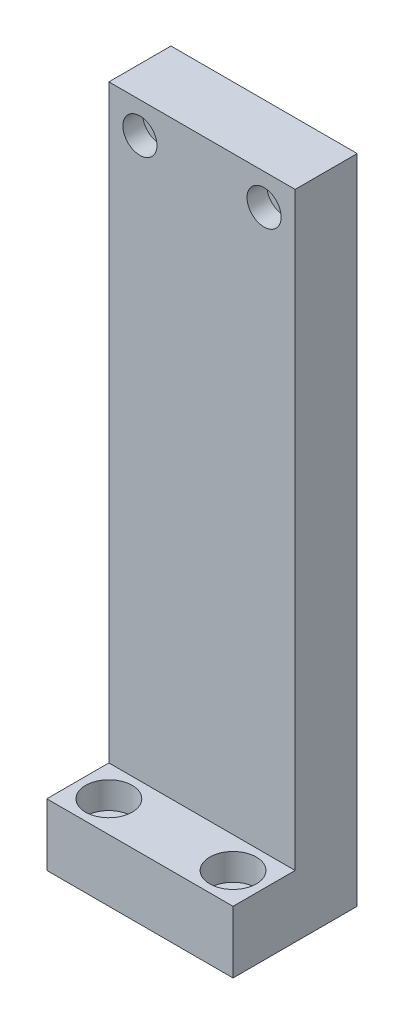
ISO-10303-21;
HEADER;
FILE_DESCRIPTION(('STEP AP214'),'2;1');
FILE_NAME('part.step','',(''),(''),'','','');
FILE_SCHEMA(('AUTOMOTIVE_DESIGN { 1 0 10303 214 1 1 1 1 }'));
ENDSEC;
DATA;
#1=APPLICATION_CONTEXT('core data for automotive mechanical design processes');
#2=APPLICATION_PROTOCOL_DEFINITION('international standard','automotive_design',2000,#1);
#3=PRODUCT_CONTEXT('',#1,'mechanical');
#4=PRODUCT('Part','Part','',(#3));
#5=PRODUCT_RELATED_PRODUCT_CATEGORY('part','',(#4));
#6=PRODUCT_DEFINITION_FORMATION('','',#4);
#7=PRODUCT_DEFINITION_CONTEXT('part definition',#1,'design');
#8=PRODUCT_DEFINITION('design','',#6,#7);
#9=PRODUCT_DEFINITION_SHAPE('','',#8);
#10=(LENGTH_UNIT() NAMED_UNIT(*) SI_UNIT(.MILLI.,.METRE.));
#11=(NAMED_UNIT(*) PLANE_ANGLE_UNIT() SI_UNIT($,.RADIAN.));
#12=(NAMED_UNIT(*) SI_UNIT($,.STERADIAN.) SOLID_ANGLE_UNIT());
#13=UNCERTAINTY_MEASURE_WITH_UNIT(LENGTH_MEASURE(1.E-05),#10,'distance_accuracy_value','');
#14=(GEOMETRIC_REPRESENTATION_CONTEXT(3) GLOBAL_UNCERTAINTY_ASSIGNED_CONTEXT((#13)) GLOBAL_UNIT_ASSIGNED_CONTEXT((#10,
#11,#12)) REPRESENTATION_CONTEXT('',''));
#15=CARTESIAN_POINT('',(0.,0.,0.));
#16=DIRECTION('',(0.,0.,1.));
#17=DIRECTION('',(1.,0.,0.));
#18=AXIS2_PLACEMENT_3D('',#15,#16,#17);
#19=CARTESIAN_POINT('',(30.,105.,40.));
#20=DIRECTION('',(0.,-1.,0.));
#21=DIRECTION('',(0.,0.,-1.));
#22=AXIS2_PLACEMENT_3D('',#19,#20,#21);
#23=PLANE('',#22);
#24=DIRECTION('',(1.,0.,0.));
#25=VECTOR('',#24,1.);
#26=CARTESIAN_POINT('',(-30.,105.,20.));
#27=LINE('',#26,#25);
#28=CARTESIAN_POINT('',(-30.,105.,20.));
#29=VERTEX_POINT('',#28);
#30=CARTESIAN_POINT('',(30.,105.,20.));
#31=VERTEX_POINT('',#30);
#32=EDGE_CURVE('E132',#29,#31,#27,.T.);
#33=ORIENTED_EDGE('',*,*,#32,.T.);
#34=DIRECTION('',(0.,0.,-1.));
#35=VECTOR('',#34,1.);
#36=CARTESIAN_POINT('',(30.,105.,40.));
#37=LINE('',#36,#35);
#38=CARTESIAN_POINT('',(30.,105.,0.));
#39=VERTEX_POINT('',#38);
#40=EDGE_CURVE('E91',#31,#39,#37,.T.);
#41=ORIENTED_EDGE('',*,*,#40,.T.);
#42=DIRECTION('',(-1.,0.,0.));
#43=VECTOR('',#42,1.);
#44=CARTESIAN_POINT('',(30.,105.,0.));
#45=LINE('',#44,#43);
#46=CARTESIAN_POINT('',(-30.,105.,0.));
#47=VERTEX_POINT('',#46);
#48=EDGE_CURVE('E95',#39,#47,#45,.T.);
#49=ORIENTED_EDGE('',*,*,#48,.T.);
#50=DIRECTION('',(0.,0.,-1.));
#51=VECTOR('',#50,1.);
#52=CARTESIAN_POINT('',(-30.,105.,40.));
#53=LINE('',#52,#51);
#54=EDGE_CURVE('E80',#29,#47,#53,.T.);
#55=ORIENTED_EDGE('',*,*,#54,.F.);
#56=EDGE_LOOP('',(#33,#41,#49,#55));
#57=FACE_BOUND('',#56,.T.);
#58=ADVANCED_FACE('F36',(#57),#23,.F.);
#59=CARTESIAN_POINT('',(-30.,-105.,40.));
#60=DIRECTION('',(1.,0.,0.));
#61=DIRECTION('',(0.,0.,-1.));
#62=AXIS2_PLACEMENT_3D('',#59,#60,#61);
#63=PLANE('',#62);
#64=DIRECTION('',(0.,-1.,0.));
#65=VECTOR('',#64,1.);
#66=CARTESIAN_POINT('',(-30.,-105.,40.));
#67=LINE('',#66,#65);
#68=CARTESIAN_POINT('',(-30.,-85.,40.));
#69=VERTEX_POINT('',#68);
#70=CARTESIAN_POINT('',(-30.,-105.,40.));
#71=VERTEX_POINT('',#70);
#72=EDGE_CURVE('E100',#69,#71,#67,.T.);
#73=ORIENTED_EDGE('',*,*,#72,.F.);
#74=DIRECTION('',(0.,0.,1.));
#75=VECTOR('',#74,1.);
#76=CARTESIAN_POINT('',(-30.,-85.,-199.248588451713));
#77=LINE('',#76,#75);
#78=CARTESIAN_POINT('',(-30.,-85.,20.));
#79=VERTEX_POINT('',#78);
#80=EDGE_CURVE('E51',#79,#69,#77,.T.);
#81=ORIENTED_EDGE('',*,*,#80,.F.);
#82=DIRECTION('',(0.,1.,0.));
#83=VECTOR('',#82,1.);
#84=CARTESIAN_POINT('',(-30.,105.,20.));
#85=LINE('',#84,#83);
#86=EDGE_CURVE('E88',#79,#29,#85,.T.);
#87=ORIENTED_EDGE('',*,*,#86,.T.);
#88=ORIENTED_EDGE('',*,*,#54,.T.);
#89=DIRECTION('',(0.,-1.,0.));
#90=VECTOR('',#89,1.);
#91=CARTESIAN_POINT('',(-30.,-105.,0.));
#92=LINE('',#91,#90);
#93=CARTESIAN_POINT('',(-30.,-105.,0.));
#94=VERTEX_POINT('',#93);
#95=EDGE_CURVE('E85',#47,#94,#92,.T.);
#96=ORIENTED_EDGE('',*,*,#95,.T.);
#97=DIRECTION('',(0.,0.,-1.));
#98=VECTOR('',#97,1.);
#99=CARTESIAN_POINT('',(-30.,-105.,40.));
#100=LINE('',#99,#98);
#101=EDGE_CURVE('E12',#71,#94,#100,.T.);
#102=ORIENTED_EDGE('',*,*,#101,.F.);
#103=EDGE_LOOP('',(#73,#81,#87,#88,#96,#102));
#104=FACE_BOUND('',#103,.T.);
#105=ADVANCED_FACE('F38',(#104),#63,.F.);
#106=CARTESIAN_POINT('',(30.,-105.,40.));
#107=DIRECTION('',(0.,1.,0.));
#108=DIRECTION('',(0.,0.,1.));
#109=AXIS2_PLACEMENT_3D('',#106,#107,#108);
#110=PLANE('',#109);
#111=CARTESIAN_POINT('',(-20.,-105.,30.));
#112=DIRECTION('',(0.,1.,0.));
#113=DIRECTION('',(0.,0.,1.));
#114=AXIS2_PLACEMENT_3D('',#111,#112,#113);
#115=CIRCLE('',#114,4.20000000000001);
#116=CARTESIAN_POINT('',(-20.,-105.,34.2));
#117=VERTEX_POINT('',#116);
#118=EDGE_CURVE('E170',#117,#117,#115,.T.);
#119=ORIENTED_EDGE('',*,*,#118,.T.);
#120=EDGE_LOOP('',(#119));
#121=FACE_BOUND('',#120,.T.);
#122=CARTESIAN_POINT('',(20.,-105.,30.));
#123=DIRECTION('',(0.,1.,0.));
#124=DIRECTION('',(0.,0.,1.));
#125=AXIS2_PLACEMENT_3D('',#122,#123,#124);
#126=CIRCLE('',#125,4.20000000000001);
#127=CARTESIAN_POINT('',(20.,-105.,34.2));
#128=VERTEX_POINT('',#127);
#129=EDGE_CURVE('E158',#128,#128,#126,.T.);
#130=ORIENTED_EDGE('',*,*,#129,.T.);
#131=EDGE_LOOP('',(#130));
#132=FACE_BOUND('',#131,.T.);
#133=DIRECTION('',(1.,0.,0.));
#134=VECTOR('',#133,1.);
#135=CARTESIAN_POINT('',(30.,-105.,0.));
#136=LINE('',#135,#134);
#137=CARTESIAN_POINT('',(30.,-105.,0.));
#138=VERTEX_POINT('',#137);
#139=EDGE_CURVE('E104',#94,#138,#136,.T.);
#140=ORIENTED_EDGE('',*,*,#139,.T.);
#141=DIRECTION('',(0.,0.,-1.));
#142=VECTOR('',#141,1.);
#143=CARTESIAN_POINT('',(30.,-105.,40.));
#144=LINE('',#143,#142);
#145=CARTESIAN_POINT('',(30.,-105.,40.));
#146=VERTEX_POINT('',#145);
#147=EDGE_CURVE('E44',#146,#138,#144,.T.);
#148=ORIENTED_EDGE('',*,*,#147,.F.);
#149=DIRECTION('',(1.,0.,0.));
#150=VECTOR('',#149,1.);
#151=CARTESIAN_POINT('',(30.,-105.,40.));
#152=LINE('',#151,#150);
#153=EDGE_CURVE('E60',#71,#146,#152,.T.);
#154=ORIENTED_EDGE('',*,*,#153,.F.);
#155=ORIENTED_EDGE('',*,*,#101,.T.);
#156=EDGE_LOOP('',(#140,#148,#154,#155));
#157=FACE_BOUND('',#156,.T.);
#158=ADVANCED_FACE('F120',(#121,#132,#157),#110,.F.);
#159=CARTESIAN_POINT('',(30.,-105.,40.));
#160=DIRECTION('',(-1.,0.,0.));
#161=DIRECTION('',(0.,0.,1.));
#162=AXIS2_PLACEMENT_3D('',#159,#160,#161);
#163=PLANE('',#162);
#164=DIRECTION('',(0.,-1.,0.));
#165=VECTOR('',#164,1.);
#166=CARTESIAN_POINT('',(30.,105.,20.));
#167=LINE('',#166,#165);
#168=CARTESIAN_POINT('',(30.,-85.,19.9999999999999));
#169=VERTEX_POINT('',#168);
#170=EDGE_CURVE('E128',#31,#169,#167,.T.);
#171=ORIENTED_EDGE('',*,*,#170,.T.);
#172=DIRECTION('',(0.,0.,1.));
#173=VECTOR('',#172,1.);
#174=CARTESIAN_POINT('',(30.,-85.,-199.248588451713));
#175=LINE('',#174,#173);
#176=CARTESIAN_POINT('',(30.,-85.,40.));
#177=VERTEX_POINT('',#176);
#178=EDGE_CURVE('E125',#169,#177,#175,.T.);
#179=ORIENTED_EDGE('',*,*,#178,.T.);
#180=DIRECTION('',(0.,1.,0.));
#181=VECTOR('',#180,1.);
#182=CARTESIAN_POINT('',(30.,-105.,40.));
#183=LINE('',#182,#181);
#184=EDGE_CURVE('E92',#146,#177,#183,.T.);
#185=ORIENTED_EDGE('',*,*,#184,.F.);
#186=ORIENTED_EDGE('',*,*,#147,.T.);
#187=DIRECTION('',(0.,1.,0.));
#188=VECTOR('',#187,1.);
#189=CARTESIAN_POINT('',(30.,-105.,0.));
#190=LINE('',#189,#188);
#191=EDGE_CURVE('E101',#138,#39,#190,.T.);
#192=ORIENTED_EDGE('',*,*,#191,.T.);
#193=ORIENTED_EDGE('',*,*,#40,.F.);
#194=EDGE_LOOP('',(#171,#179,#185,#186,#192,#193));
#195=FACE_BOUND('',#194,.T.);
#196=ADVANCED_FACE('F117',(#195),#163,.F.);
#197=CARTESIAN_POINT('',(0.,0.,40.));
#198=DIRECTION('',(0.,0.,1.));
#199=DIRECTION('',(1.,0.,0.));
#200=AXIS2_PLACEMENT_3D('',#197,#198,#199);
#201=PLANE('',#200);
#202=DIRECTION('',(1.,0.,0.));
#203=VECTOR('',#202,1.);
#204=CARTESIAN_POINT('',(-30.,-85.,40.));
#205=LINE('',#204,#203);
#206=EDGE_CURVE('E126',#69,#177,#205,.T.);
#207=ORIENTED_EDGE('',*,*,#206,.F.);
#208=ORIENTED_EDGE('',*,*,#72,.T.);
#209=ORIENTED_EDGE('',*,*,#153,.T.);
#210=ORIENTED_EDGE('',*,*,#184,.T.);
#211=EDGE_LOOP('',(#207,#208,#209,#210));
#212=FACE_BOUND('',#211,.T.);
#213=ADVANCED_FACE('F202',(#212),#201,.T.);
#214=CARTESIAN_POINT('',(0.,0.,0.));
#215=DIRECTION('',(0.,0.,1.));
#216=DIRECTION('',(1.,0.,0.));
#217=AXIS2_PLACEMENT_3D('',#214,#215,#216);
#218=PLANE('',#217);
#219=CARTESIAN_POINT('',(-20.0000000000001,95.,0.));
#220=DIRECTION('',(0.,0.,1.));
#221=DIRECTION('',(1.,0.,0.));
#222=AXIS2_PLACEMENT_3D('',#219,#220,#221);
#223=CIRCLE('',#222,3.19999999999999);
#224=CARTESIAN_POINT('',(-16.8000000000001,95.,0.));
#225=VERTEX_POINT('',#224);
#226=EDGE_CURVE('E146',#225,#225,#223,.T.);
#227=ORIENTED_EDGE('',*,*,#226,.T.);
#228=EDGE_LOOP('',(#227));
#229=FACE_BOUND('',#228,.T.);
#230=CARTESIAN_POINT('',(19.9999999999999,95.,0.));
#231=DIRECTION('',(0.,0.,1.));
#232=DIRECTION('',(1.,0.,0.));
#233=AXIS2_PLACEMENT_3D('',#230,#231,#232);
#234=CIRCLE('',#233,3.19999999999999);
#235=CARTESIAN_POINT('',(23.1999999999999,95.,0.));
#236=VERTEX_POINT('',#235);
#237=EDGE_CURVE('E130',#236,#236,#234,.T.);
#238=ORIENTED_EDGE('',*,*,#237,.T.);
#239=EDGE_LOOP('',(#238));
#240=FACE_BOUND('',#239,.T.);
#241=ORIENTED_EDGE('',*,*,#95,.F.);
#242=ORIENTED_EDGE('',*,*,#48,.F.);
#243=ORIENTED_EDGE('',*,*,#191,.F.);
#244=ORIENTED_EDGE('',*,*,#139,.F.);
#245=EDGE_LOOP('',(#241,#242,#243,#244));
#246=FACE_BOUND('',#245,.T.);
#247=ADVANCED_FACE('F103',(#229,#240,#246),#218,.F.);
#248=CARTESIAN_POINT('',(-30.,-85.,-199.248588451713));
#249=DIRECTION('',(0.,-1.,0.));
#250=DIRECTION('',(0.,0.,-1.));
#251=AXIS2_PLACEMENT_3D('',#248,#249,#250);
#252=PLANE('',#251);
#253=CARTESIAN_POINT('',(-20.,-85.,30.));
#254=DIRECTION('',(0.,1.,0.));
#255=DIRECTION('',(0.,0.,1.));
#256=AXIS2_PLACEMENT_3D('',#253,#254,#255);
#257=CIRCLE('',#256,7.5);
#258=CARTESIAN_POINT('',(-20.,-85.,37.5));
#259=VERTEX_POINT('',#258);
#260=EDGE_CURVE('E179',#259,#259,#257,.T.);
#261=ORIENTED_EDGE('',*,*,#260,.F.);
#262=EDGE_LOOP('',(#261));
#263=FACE_BOUND('',#262,.T.);
#264=CARTESIAN_POINT('',(20.,-85.,30.));
#265=DIRECTION('',(0.,1.,0.));
#266=DIRECTION('',(0.,0.,1.));
#267=AXIS2_PLACEMENT_3D('',#264,#265,#266);
#268=CIRCLE('',#267,7.5);
#269=CARTESIAN_POINT('',(20.,-85.,37.5));
#270=VERTEX_POINT('',#269);
#271=EDGE_CURVE('E167',#270,#270,#268,.T.);
#272=ORIENTED_EDGE('',*,*,#271,.F.);
#273=EDGE_LOOP('',(#272));
#274=FACE_BOUND('',#273,.T.);
#275=DIRECTION('',(-1.,0.,0.));
#276=VECTOR('',#275,1.);
#277=CARTESIAN_POINT('',(-30.,-85.,20.));
#278=LINE('',#277,#276);
#279=EDGE_CURVE('E105',#169,#79,#278,.T.);
#280=ORIENTED_EDGE('',*,*,#279,.T.);
#281=ORIENTED_EDGE('',*,*,#80,.T.);
#282=ORIENTED_EDGE('',*,*,#206,.T.);
#283=ORIENTED_EDGE('',*,*,#178,.F.);
#284=EDGE_LOOP('',(#280,#281,#282,#283));
#285=FACE_BOUND('',#284,.T.);
#286=ADVANCED_FACE('F185',(#263,#274,#285),#252,.F.);
#287=CARTESIAN_POINT('',(0.,0.,20.));
#288=DIRECTION('',(0.,0.,1.));
#289=DIRECTION('',(1.,0.,0.));
#290=AXIS2_PLACEMENT_3D('',#287,#288,#289);
#291=PLANE('',#290);
#292=CARTESIAN_POINT('',(-20.0000000000001,95.,20.));
#293=DIRECTION('',(0.,0.,1.));
#294=DIRECTION('',(1.,0.,0.));
#295=AXIS2_PLACEMENT_3D('',#292,#293,#294);
#296=CIRCLE('',#295,5.5);
#297=CARTESIAN_POINT('',(-14.5000000000001,95.,20.));
#298=VERTEX_POINT('',#297);
#299=EDGE_CURVE('E155',#298,#298,#296,.T.);
#300=ORIENTED_EDGE('',*,*,#299,.F.);
#301=EDGE_LOOP('',(#300));
#302=FACE_BOUND('',#301,.T.);
#303=CARTESIAN_POINT('',(19.9999999999999,95.,20.));
#304=DIRECTION('',(0.,0.,1.));
#305=DIRECTION('',(1.,0.,0.));
#306=AXIS2_PLACEMENT_3D('',#303,#304,#305);
#307=CIRCLE('',#306,5.5);
#308=CARTESIAN_POINT('',(25.4999999999999,95.,20.));
#309=VERTEX_POINT('',#308);
#310=EDGE_CURVE('E143',#309,#309,#307,.T.);
#311=ORIENTED_EDGE('',*,*,#310,.F.);
#312=EDGE_LOOP('',(#311));
#313=FACE_BOUND('',#312,.T.);
#314=ORIENTED_EDGE('',*,*,#86,.F.);
#315=ORIENTED_EDGE('',*,*,#279,.F.);
#316=ORIENTED_EDGE('',*,*,#170,.F.);
#317=ORIENTED_EDGE('',*,*,#32,.F.);
#318=EDGE_LOOP('',(#314,#315,#316,#317));
#319=FACE_BOUND('',#318,.T.);
#320=ADVANCED_FACE('F188',(#302,#313,#319),#291,.T.);
#321=CARTESIAN_POINT('',(19.9999999999999,95.,20.));
#322=DIRECTION('',(0.,0.,1.));
#323=DIRECTION('',(1.,0.,0.));
#324=AXIS2_PLACEMENT_3D('',#321,#322,#323);
#325=CYLINDRICAL_SURFACE('',#324,3.2);
#326=ORIENTED_EDGE('',*,*,#237,.F.);
#327=EDGE_LOOP('',(#326));
#328=FACE_BOUND('',#327,.T.);
#329=CARTESIAN_POINT('',(19.9999999999999,95.,13.6));
#330=DIRECTION('',(0.,0.,1.));
#331=DIRECTION('',(1.,0.,0.));
#332=AXIS2_PLACEMENT_3D('',#329,#330,#331);
#333=CIRCLE('',#332,3.2);
#334=CARTESIAN_POINT('',(23.1999999999999,95.,13.6));
#335=VERTEX_POINT('',#334);
#336=EDGE_CURVE('E137',#335,#335,#333,.T.);
#337=ORIENTED_EDGE('',*,*,#336,.T.);
#338=EDGE_LOOP('',(#337));
#339=FACE_BOUND('',#338,.T.);
#340=ADVANCED_FACE('F269',(#328,#339),#325,.F.);
#341=CARTESIAN_POINT('',(23.1999999999999,95.,13.6));
#342=DIRECTION('',(0.,0.,-1.));
#343=DIRECTION('',(-1.,0.,0.));
#344=AXIS2_PLACEMENT_3D('',#341,#342,#343);
#345=PLANE('',#344);
#346=ORIENTED_EDGE('',*,*,#336,.F.);
#347=EDGE_LOOP('',(#346));
#348=FACE_BOUND('',#347,.T.);
#349=CARTESIAN_POINT('',(19.9999999999999,95.,13.6));
#350=DIRECTION('',(0.,0.,1.));
#351=DIRECTION('',(1.,0.,0.));
#352=AXIS2_PLACEMENT_3D('',#349,#350,#351);
#353=CIRCLE('',#352,5.5);
#354=CARTESIAN_POINT('',(25.4999999999999,95.,13.6));
#355=VERTEX_POINT('',#354);
#356=EDGE_CURVE('E140',#355,#355,#353,.T.);
#357=ORIENTED_EDGE('',*,*,#356,.T.);
#358=EDGE_LOOP('',(#357));
#359=FACE_BOUND('',#358,.T.);
#360=ADVANCED_FACE('F265',(#348,#359),#345,.F.);
#361=CARTESIAN_POINT('',(19.9999999999999,95.,20.));
#362=DIRECTION('',(0.,0.,1.));
#363=DIRECTION('',(1.,0.,0.));
#364=AXIS2_PLACEMENT_3D('',#361,#362,#363);
#365=CYLINDRICAL_SURFACE('',#364,5.5);
#366=ORIENTED_EDGE('',*,*,#356,.F.);
#367=EDGE_LOOP('',(#366));
#368=FACE_BOUND('',#367,.T.);
#369=ORIENTED_EDGE('',*,*,#310,.T.);
#370=EDGE_LOOP('',(#369));
#371=FACE_BOUND('',#370,.T.);
#372=ADVANCED_FACE('F261',(#368,#371),#365,.F.);
#373=CARTESIAN_POINT('',(-20.0000000000001,95.,20.));
#374=DIRECTION('',(0.,0.,1.));
#375=DIRECTION('',(1.,0.,0.));
#376=AXIS2_PLACEMENT_3D('',#373,#374,#375);
#377=CYLINDRICAL_SURFACE('',#376,3.2);
#378=ORIENTED_EDGE('',*,*,#226,.F.);
#379=EDGE_LOOP('',(#378));
#380=FACE_BOUND('',#379,.T.);
#381=CARTESIAN_POINT('',(-20.0000000000001,95.,13.6));
#382=DIRECTION('',(0.,0.,1.));
#383=DIRECTION('',(1.,0.,0.));
#384=AXIS2_PLACEMENT_3D('',#381,#382,#383);
#385=CIRCLE('',#384,3.2);
#386=CARTESIAN_POINT('',(-16.8000000000001,95.,13.6));
#387=VERTEX_POINT('',#386);
#388=EDGE_CURVE('E149',#387,#387,#385,.T.);
#389=ORIENTED_EDGE('',*,*,#388,.T.);
#390=EDGE_LOOP('',(#389));
#391=FACE_BOUND('',#390,.T.);
#392=ADVANCED_FACE('F257',(#380,#391),#377,.F.);
#393=CARTESIAN_POINT('',(-16.8000000000001,95.,13.6));
#394=DIRECTION('',(0.,0.,-1.));
#395=DIRECTION('',(-1.,0.,0.));
#396=AXIS2_PLACEMENT_3D('',#393,#394,#395);
#397=PLANE('',#396);
#398=ORIENTED_EDGE('',*,*,#388,.F.);
#399=EDGE_LOOP('',(#398));
#400=FACE_BOUND('',#399,.T.);
#401=CARTESIAN_POINT('',(-20.0000000000001,95.,13.6));
#402=DIRECTION('',(0.,0.,1.));
#403=DIRECTION('',(1.,0.,0.));
#404=AXIS2_PLACEMENT_3D('',#401,#402,#403);
#405=CIRCLE('',#404,5.5);
#406=CARTESIAN_POINT('',(-14.5000000000001,95.,13.6));
#407=VERTEX_POINT('',#406);
#408=EDGE_CURVE('E152',#407,#407,#405,.T.);
#409=ORIENTED_EDGE('',*,*,#408,.T.);
#410=EDGE_LOOP('',(#409));
#411=FACE_BOUND('',#410,.T.);
#412=ADVANCED_FACE('F253',(#400,#411),#397,.F.);
#413=CARTESIAN_POINT('',(-20.0000000000001,95.,20.));
#414=DIRECTION('',(0.,0.,1.));
#415=DIRECTION('',(1.,0.,0.));
#416=AXIS2_PLACEMENT_3D('',#413,#414,#415);
#417=CYLINDRICAL_SURFACE('',#416,5.5);
#418=ORIENTED_EDGE('',*,*,#408,.F.);
#419=EDGE_LOOP('',(#418));
#420=FACE_BOUND('',#419,.T.);
#421=ORIENTED_EDGE('',*,*,#299,.T.);
#422=EDGE_LOOP('',(#421));
#423=FACE_BOUND('',#422,.T.);
#424=ADVANCED_FACE('F229',(#420,#423),#417,.F.);
#425=CARTESIAN_POINT('',(20.,-85.,30.));
#426=DIRECTION('',(0.,1.,0.));
#427=DIRECTION('',(0.,0.,1.));
#428=AXIS2_PLACEMENT_3D('',#425,#426,#427);
#429=CYLINDRICAL_SURFACE('',#428,4.2);
#430=ORIENTED_EDGE('',*,*,#129,.F.);
#431=EDGE_LOOP('',(#430));
#432=FACE_BOUND('',#431,.T.);
#433=CARTESIAN_POINT('',(20.,-93.6,30.));
#434=DIRECTION('',(0.,1.,0.));
#435=DIRECTION('',(0.,0.,1.));
#436=AXIS2_PLACEMENT_3D('',#433,#434,#435);
#437=CIRCLE('',#436,4.2);
#438=CARTESIAN_POINT('',(20.,-93.6,34.2));
#439=VERTEX_POINT('',#438);
#440=EDGE_CURVE('E161',#439,#439,#437,.T.);
#441=ORIENTED_EDGE('',*,*,#440,.T.);
#442=EDGE_LOOP('',(#441));
#443=FACE_BOUND('',#442,.T.);
#444=ADVANCED_FACE('F225',(#432,#443),#429,.F.);
#445=CARTESIAN_POINT('',(24.2,-93.6,30.));
#446=DIRECTION('',(0.,-1.,0.));
#447=DIRECTION('',(0.,0.,-1.));
#448=AXIS2_PLACEMENT_3D('',#445,#446,#447);
#449=PLANE('',#448);
#450=ORIENTED_EDGE('',*,*,#440,.F.);
#451=EDGE_LOOP('',(#450));
#452=FACE_BOUND('',#451,.T.);
#453=CARTESIAN_POINT('',(20.,-93.6,30.));
#454=DIRECTION('',(0.,1.,0.));
#455=DIRECTION('',(0.,0.,1.));
#456=AXIS2_PLACEMENT_3D('',#453,#454,#455);
#457=CIRCLE('',#456,7.5);
#458=CARTESIAN_POINT('',(20.,-93.6,37.5));
#459=VERTEX_POINT('',#458);
#460=EDGE_CURVE('E164',#459,#459,#457,.T.);
#461=ORIENTED_EDGE('',*,*,#460,.T.);
#462=EDGE_LOOP('',(#461));
#463=FACE_BOUND('',#462,.T.);
#464=ADVANCED_FACE('F228',(#452,#463),#449,.F.);
#465=CARTESIAN_POINT('',(20.,-85.,30.));
#466=DIRECTION('',(0.,1.,0.));
#467=DIRECTION('',(0.,0.,1.));
#468=AXIS2_PLACEMENT_3D('',#465,#466,#467);
#469=CYLINDRICAL_SURFACE('',#468,7.5);
#470=ORIENTED_EDGE('',*,*,#460,.F.);
#471=EDGE_LOOP('',(#470));
#472=FACE_BOUND('',#471,.T.);
#473=ORIENTED_EDGE('',*,*,#271,.T.);
#474=EDGE_LOOP('',(#473));
#475=FACE_BOUND('',#474,.T.);
#476=ADVANCED_FACE('F235',(#472,#475),#469,.F.);
#477=CARTESIAN_POINT('',(-20.,-85.,30.));
#478=DIRECTION('',(0.,1.,0.));
#479=DIRECTION('',(0.,0.,1.));
#480=AXIS2_PLACEMENT_3D('',#477,#478,#479);
#481=CYLINDRICAL_SURFACE('',#480,4.2);
#482=ORIENTED_EDGE('',*,*,#118,.F.);
#483=EDGE_LOOP('',(#482));
#484=FACE_BOUND('',#483,.T.);
#485=CARTESIAN_POINT('',(-20.,-93.6,30.));
#486=DIRECTION('',(0.,1.,0.));
#487=DIRECTION('',(0.,0.,1.));
#488=AXIS2_PLACEMENT_3D('',#485,#486,#487);
#489=CIRCLE('',#488,4.2);
#490=CARTESIAN_POINT('',(-20.,-93.6,34.2));
#491=VERTEX_POINT('',#490);
#492=EDGE_CURVE('E173',#491,#491,#489,.T.);
#493=ORIENTED_EDGE('',*,*,#492,.T.);
#494=EDGE_LOOP('',(#493));
#495=FACE_BOUND('',#494,.T.);
#496=ADVANCED_FACE('F241',(#484,#495),#481,.F.);
#497=CARTESIAN_POINT('',(-15.8,-93.6,30.));
#498=DIRECTION('',(0.,-1.,0.));
#499=DIRECTION('',(0.,0.,-1.));
#500=AXIS2_PLACEMENT_3D('',#497,#498,#499);
#501=PLANE('',#500);
#502=ORIENTED_EDGE('',*,*,#492,.F.);
#503=EDGE_LOOP('',(#502));
#504=FACE_BOUND('',#503,.T.);
#505=CARTESIAN_POINT('',(-20.,-93.6,30.));
#506=DIRECTION('',(0.,1.,0.));
#507=DIRECTION('',(0.,0.,1.));
#508=AXIS2_PLACEMENT_3D('',#505,#506,#507);
#509=CIRCLE('',#508,7.5);
#510=CARTESIAN_POINT('',(-20.,-93.6,37.5));
#511=VERTEX_POINT('',#510);
#512=EDGE_CURVE('E176',#511,#511,#509,.T.);
#513=ORIENTED_EDGE('',*,*,#512,.T.);
#514=EDGE_LOOP('',(#513));
#515=FACE_BOUND('',#514,.T.);
#516=ADVANCED_FACE('F246',(#504,#515),#501,.F.);
#517=CARTESIAN_POINT('',(-20.,-85.,30.));
#518=DIRECTION('',(0.,1.,0.));
#519=DIRECTION('',(0.,0.,1.));
#520=AXIS2_PLACEMENT_3D('',#517,#518,#519);
#521=CYLINDRICAL_SURFACE('',#520,7.5);
#522=ORIENTED_EDGE('',*,*,#512,.F.);
#523=EDGE_LOOP('',(#522));
#524=FACE_BOUND('',#523,.T.);
#525=ORIENTED_EDGE('',*,*,#260,.T.);
#526=EDGE_LOOP('',(#525));
#527=FACE_BOUND('',#526,.T.);
#528=ADVANCED_FACE('F183',(#524,#527),#521,.F.);
#529=CLOSED_SHELL('',(#58,#105,#158,#196,#213,#247,#286,#320,#340,#360,#372,#392,#412,#424,#444,
#464,#476,#496,#516,#528));
#530=MANIFOLD_SOLID_BREP('B2',#529);
#531=ADVANCED_BREP_SHAPE_REPRESENTATION('',(#18,#530),#14);
#532=SHAPE_DEFINITION_REPRESENTATION(#9,#531);
ENDSEC;
END-ISO-10303-21;
